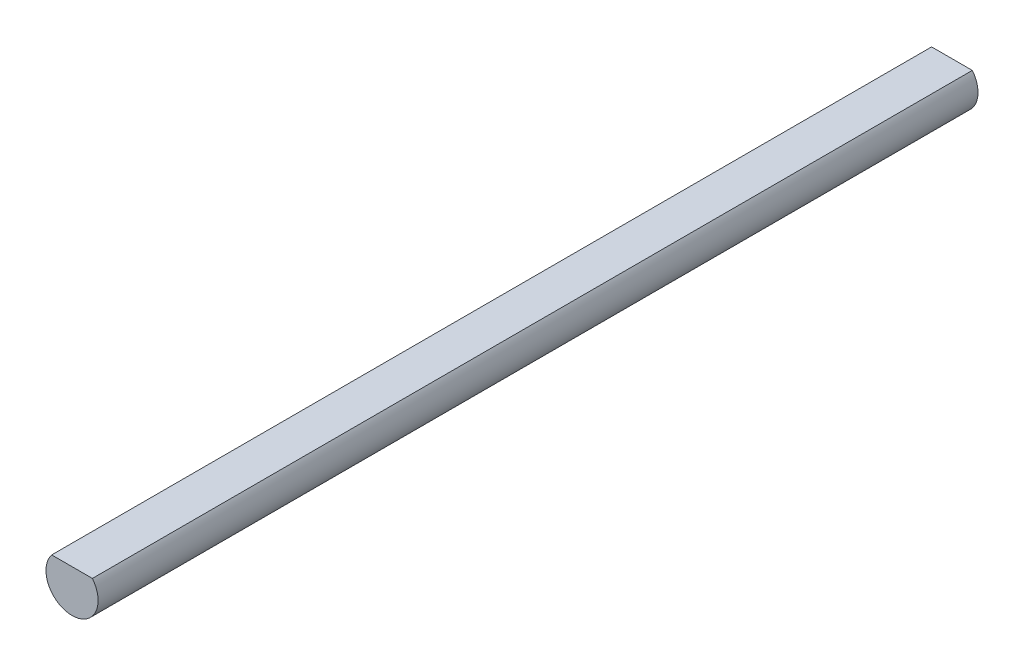
ISO-10303-21;
HEADER;
FILE_DESCRIPTION(('STEP AP214'),'2;1');
FILE_NAME('part.step','',(''),(''),'','','');
FILE_SCHEMA(('AUTOMOTIVE_DESIGN { 1 0 10303 214 1 1 1 1 }'));
ENDSEC;
DATA;
#1=APPLICATION_CONTEXT('core data for automotive mechanical design processes');
#2=APPLICATION_PROTOCOL_DEFINITION('international standard','automotive_design',2000,#1);
#3=PRODUCT_CONTEXT('',#1,'mechanical');
#4=PRODUCT('Part','Part','',(#3));
#5=PRODUCT_RELATED_PRODUCT_CATEGORY('part','',(#4));
#6=PRODUCT_DEFINITION_FORMATION('','',#4);
#7=PRODUCT_DEFINITION_CONTEXT('part definition',#1,'design');
#8=PRODUCT_DEFINITION('design','',#6,#7);
#9=PRODUCT_DEFINITION_SHAPE('','',#8);
#10=(LENGTH_UNIT() NAMED_UNIT(*) SI_UNIT(.MILLI.,.METRE.));
#11=(NAMED_UNIT(*) PLANE_ANGLE_UNIT() SI_UNIT($,.RADIAN.));
#12=(NAMED_UNIT(*) SI_UNIT($,.STERADIAN.) SOLID_ANGLE_UNIT());
#13=UNCERTAINTY_MEASURE_WITH_UNIT(LENGTH_MEASURE(1.E-05),#10,'distance_accuracy_value','');
#14=(GEOMETRIC_REPRESENTATION_CONTEXT(3) GLOBAL_UNCERTAINTY_ASSIGNED_CONTEXT((#13)) GLOBAL_UNIT_ASSIGNED_CONTEXT((#10,
#11,#12)) REPRESENTATION_CONTEXT('',''));
#15=CARTESIAN_POINT('',(0.,0.,0.));
#16=DIRECTION('',(0.,0.,1.));
#17=DIRECTION('',(1.,0.,0.));
#18=AXIS2_PLACEMENT_3D('',#15,#16,#17);
#19=CARTESIAN_POINT('',(0.,0.,135.));
#20=DIRECTION('',(0.,0.,-1.));
#21=DIRECTION('',(-1.,0.,0.));
#22=AXIS2_PLACEMENT_3D('',#19,#20,#21);
#23=CYLINDRICAL_SURFACE('',#22,4.);
#24=DIRECTION('',(0.,0.,-1.));
#25=VECTOR('',#24,1.);
#26=CARTESIAN_POINT('',(3.1224989991992,2.5,135.));
#27=LINE('',#26,#25);
#28=CARTESIAN_POINT('',(3.1224989991992,2.5,135.));
#29=VERTEX_POINT('',#28);
#30=CARTESIAN_POINT('',(3.1224989991992,2.5,0.));
#31=VERTEX_POINT('',#30);
#32=EDGE_CURVE('E63',#29,#31,#27,.T.);
#33=ORIENTED_EDGE('',*,*,#32,.F.);
#34=CARTESIAN_POINT('',(0.,0.,135.));
#35=DIRECTION('',(0.,0.,1.));
#36=DIRECTION('',(1.,0.,0.));
#37=AXIS2_PLACEMENT_3D('',#34,#35,#36);
#38=CIRCLE('',#37,4.);
#39=CARTESIAN_POINT('',(-3.1224989991992,2.5,135.));
#40=VERTEX_POINT('',#39);
#41=EDGE_CURVE('E58',#40,#29,#38,.T.);
#42=ORIENTED_EDGE('',*,*,#41,.F.);
#43=DIRECTION('',(0.,0.,-1.));
#44=VECTOR('',#43,1.);
#45=CARTESIAN_POINT('',(-3.1224989991992,2.5,135.));
#46=LINE('',#45,#44);
#47=CARTESIAN_POINT('',(-3.1224989991992,2.5,0.));
#48=VERTEX_POINT('',#47);
#49=EDGE_CURVE('E71',#40,#48,#46,.T.);
#50=ORIENTED_EDGE('',*,*,#49,.T.);
#51=CARTESIAN_POINT('',(0.,0.,0.));
#52=DIRECTION('',(0.,0.,1.));
#53=DIRECTION('',(1.,0.,0.));
#54=AXIS2_PLACEMENT_3D('',#51,#52,#53);
#55=CIRCLE('',#54,4.);
#56=EDGE_CURVE('E80',#48,#31,#55,.T.);
#57=ORIENTED_EDGE('',*,*,#56,.T.);
#58=EDGE_LOOP('',(#33,#42,#50,#57));
#59=FACE_BOUND('',#58,.T.);
#60=ADVANCED_FACE('F49',(#59),#23,.T.);
#61=CARTESIAN_POINT('',(0.,0.,135.));
#62=DIRECTION('',(0.,0.,1.));
#63=DIRECTION('',(1.,0.,0.));
#64=AXIS2_PLACEMENT_3D('',#61,#62,#63);
#65=PLANE('',#64);
#66=ORIENTED_EDGE('',*,*,#41,.T.);
#67=DIRECTION('',(1.,0.,0.));
#68=VECTOR('',#67,1.);
#69=CARTESIAN_POINT('',(-3.1224989991992,2.5,135.));
#70=LINE('',#69,#68);
#71=EDGE_CURVE('E74',#40,#29,#70,.T.);
#72=ORIENTED_EDGE('',*,*,#71,.F.);
#73=EDGE_LOOP('',(#66,#72));
#74=FACE_BOUND('',#73,.T.);
#75=ADVANCED_FACE('F84',(#74),#65,.T.);
#76=CARTESIAN_POINT('',(0.,0.,0.));
#77=DIRECTION('',(0.,0.,1.));
#78=DIRECTION('',(1.,0.,0.));
#79=AXIS2_PLACEMENT_3D('',#76,#77,#78);
#80=PLANE('',#79);
#81=DIRECTION('',(1.,0.,0.));
#82=VECTOR('',#81,1.);
#83=CARTESIAN_POINT('',(-3.1224989991992,2.5,0.));
#84=LINE('',#83,#82);
#85=EDGE_CURVE('E11',#31,#48,#84,.F.);
#86=ORIENTED_EDGE('',*,*,#85,.F.);
#87=ORIENTED_EDGE('',*,*,#56,.F.);
#88=EDGE_LOOP('',(#86,#87));
#89=FACE_BOUND('',#88,.T.);
#90=ADVANCED_FACE('F99',(#89),#80,.F.);
#91=CARTESIAN_POINT('',(-3.1224989991992,2.5,135.));
#92=DIRECTION('',(0.,1.,0.));
#93=DIRECTION('',(0.,0.,1.));
#94=AXIS2_PLACEMENT_3D('',#91,#92,#93);
#95=PLANE('',#94);
#96=ORIENTED_EDGE('',*,*,#85,.T.);
#97=ORIENTED_EDGE('',*,*,#49,.F.);
#98=ORIENTED_EDGE('',*,*,#71,.T.);
#99=ORIENTED_EDGE('',*,*,#32,.T.);
#100=EDGE_LOOP('',(#96,#97,#98,#99));
#101=FACE_BOUND('',#100,.T.);
#102=ADVANCED_FACE('F73',(#101),#95,.T.);
#103=CLOSED_SHELL('',(#60,#75,#90,#102));
#104=MANIFOLD_SOLID_BREP('B2',#103);
#105=ADVANCED_BREP_SHAPE_REPRESENTATION('',(#18,#104),#14);
#106=SHAPE_DEFINITION_REPRESENTATION(#9,#105);
ENDSEC;
END-ISO-10303-21;
